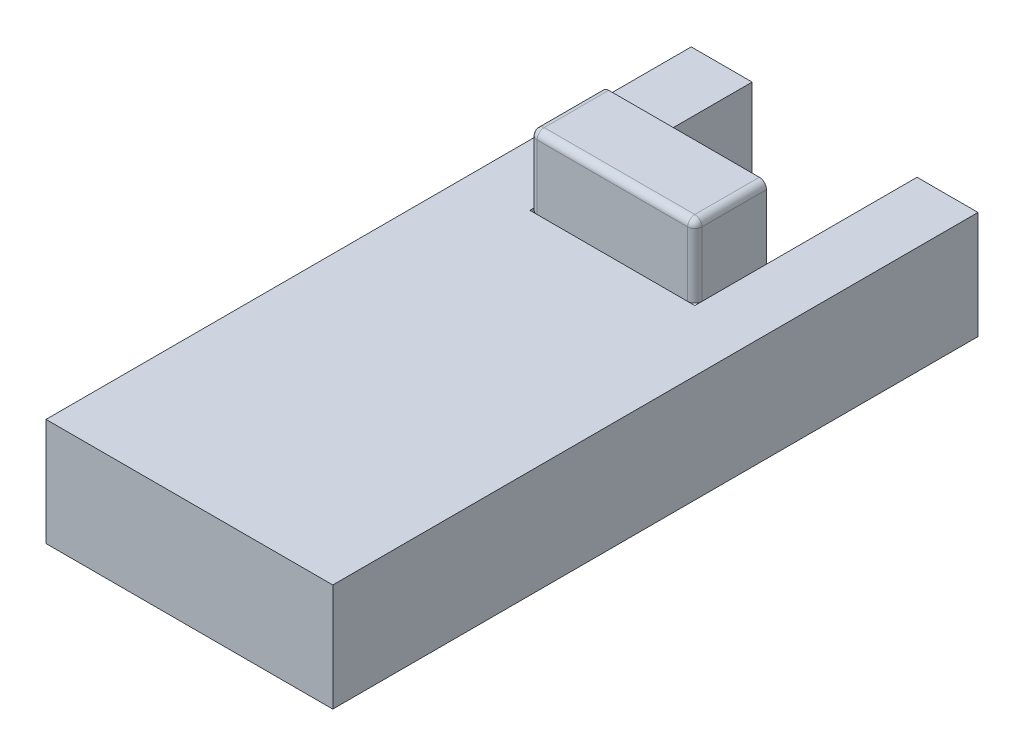
ISO-10303-21;
HEADER;
FILE_DESCRIPTION(('STEP AP214'),'2;1');
FILE_NAME('part.step','',(''),(''),'','','');
FILE_SCHEMA(('AUTOMOTIVE_DESIGN { 1 0 10303 214 1 1 1 1 }'));
ENDSEC;
DATA;
#1=APPLICATION_CONTEXT('core data for automotive mechanical design processes');
#2=APPLICATION_PROTOCOL_DEFINITION('international standard','automotive_design',2000,#1);
#3=PRODUCT_CONTEXT('',#1,'mechanical');
#4=PRODUCT('Part','Part','',(#3));
#5=PRODUCT_RELATED_PRODUCT_CATEGORY('part','',(#4));
#6=PRODUCT_DEFINITION_FORMATION('','',#4);
#7=PRODUCT_DEFINITION_CONTEXT('part definition',#1,'design');
#8=PRODUCT_DEFINITION('design','',#6,#7);
#9=PRODUCT_DEFINITION_SHAPE('','',#8);
#10=(LENGTH_UNIT() NAMED_UNIT(*) SI_UNIT(.MILLI.,.METRE.));
#11=(NAMED_UNIT(*) PLANE_ANGLE_UNIT() SI_UNIT($,.RADIAN.));
#12=(NAMED_UNIT(*) SI_UNIT($,.STERADIAN.) SOLID_ANGLE_UNIT());
#13=UNCERTAINTY_MEASURE_WITH_UNIT(LENGTH_MEASURE(1.E-05),#10,'distance_accuracy_value','');
#14=(GEOMETRIC_REPRESENTATION_CONTEXT(3) GLOBAL_UNCERTAINTY_ASSIGNED_CONTEXT((#13)) GLOBAL_UNIT_ASSIGNED_CONTEXT((#10,
#11,#12)) REPRESENTATION_CONTEXT('',''));
#15=CARTESIAN_POINT('',(0.,0.,0.));
#16=DIRECTION('',(0.,0.,1.));
#17=DIRECTION('',(1.,0.,0.));
#18=AXIS2_PLACEMENT_3D('',#15,#16,#17);
#19=CARTESIAN_POINT('',(105.,240.,-150.));
#20=DIRECTION('',(-1.,0.,0.));
#21=DIRECTION('',(0.,0.,1.));
#22=AXIS2_PLACEMENT_3D('',#19,#20,#21);
#23=SPHERICAL_SURFACE('',#22,10.);
#24=CARTESIAN_POINT('',(105.,240.,-150.));
#25=DIRECTION('',(0.,-1.,0.));
#26=DIRECTION('',(0.,0.,-1.));
#27=AXIS2_PLACEMENT_3D('',#24,#25,#26);
#28=CIRCLE('',#27,10.);
#29=CARTESIAN_POINT('',(115.,240.,-150.));
#30=VERTEX_POINT('',#29);
#31=CARTESIAN_POINT('',(105.,240.,-140.));
#32=VERTEX_POINT('',#31);
#33=EDGE_CURVE('E12',#30,#32,#28,.T.);
#34=ORIENTED_EDGE('',*,*,#33,.F.);
#35=CARTESIAN_POINT('',(105.,240.,-150.));
#36=DIRECTION('',(0.,0.,1.));
#37=DIRECTION('',(1.,0.,0.));
#38=AXIS2_PLACEMENT_3D('',#35,#36,#37);
#39=CIRCLE('',#38,10.);
#40=CARTESIAN_POINT('',(105.,250.,-150.));
#41=VERTEX_POINT('',#40);
#42=EDGE_CURVE('E56',#30,#41,#39,.T.);
#43=ORIENTED_EDGE('',*,*,#42,.T.);
#44=CARTESIAN_POINT('',(105.,240.,-150.));
#45=DIRECTION('',(-1.,0.,0.));
#46=DIRECTION('',(0.,0.,1.));
#47=AXIS2_PLACEMENT_3D('',#44,#45,#46);
#48=CIRCLE('',#47,10.);
#49=EDGE_CURVE('E176',#32,#41,#48,.T.);
#50=ORIENTED_EDGE('',*,*,#49,.F.);
#51=EDGE_LOOP('',(#34,#43,#50));
#52=FACE_BOUND('',#51,.T.);
#53=ADVANCED_FACE('F48',(#52),#23,.T.);
#54=CARTESIAN_POINT('',(105.,240.,-140.));
#55=DIRECTION('',(0.,0.,1.));
#56=DIRECTION('',(1.,0.,0.));
#57=AXIS2_PLACEMENT_3D('',#54,#55,#56);
#58=CYLINDRICAL_SURFACE('',#57,10.);
#59=ORIENTED_EDGE('',*,*,#42,.F.);
#60=DIRECTION('',(0.,0.,1.));
#61=VECTOR('',#60,1.);
#62=CARTESIAN_POINT('',(115.,240.,-140.));
#63=LINE('',#62,#61);
#64=CARTESIAN_POINT('',(115.,240.,-240.));
#65=VERTEX_POINT('',#64);
#66=EDGE_CURVE('E170',#65,#30,#63,.T.);
#67=ORIENTED_EDGE('',*,*,#66,.F.);
#68=CARTESIAN_POINT('',(105.,240.,-240.));
#69=DIRECTION('',(0.,0.,1.));
#70=DIRECTION('',(1.,0.,0.));
#71=AXIS2_PLACEMENT_3D('',#68,#69,#70);
#72=CIRCLE('',#71,10.);
#73=CARTESIAN_POINT('',(105.,250.,-240.));
#74=VERTEX_POINT('',#73);
#75=EDGE_CURVE('E120',#74,#65,#72,.F.);
#76=ORIENTED_EDGE('',*,*,#75,.F.);
#77=DIRECTION('',(0.,0.,1.));
#78=VECTOR('',#77,1.);
#79=CARTESIAN_POINT('',(105.,250.,0.));
#80=LINE('',#79,#78);
#81=EDGE_CURVE('E172',#41,#74,#80,.F.);
#82=ORIENTED_EDGE('',*,*,#81,.F.);
#83=EDGE_LOOP('',(#59,#67,#76,#82));
#84=FACE_BOUND('',#83,.T.);
#85=ADVANCED_FACE('F191',(#84),#58,.T.);
#86=CARTESIAN_POINT('',(105.,250.,-150.));
#87=DIRECTION('',(0.,-1.,0.));
#88=DIRECTION('',(0.,0.,-1.));
#89=AXIS2_PLACEMENT_3D('',#86,#87,#88);
#90=CYLINDRICAL_SURFACE('',#89,10.);
#91=DIRECTION('',(0.,-1.,0.));
#92=VECTOR('',#91,1.);
#93=CARTESIAN_POINT('',(115.,250.,-150.));
#94=LINE('',#93,#92);
#95=CARTESIAN_POINT('',(115.,150.,-150.));
#96=VERTEX_POINT('',#95);
#97=EDGE_CURVE('E130',#30,#96,#94,.T.);
#98=ORIENTED_EDGE('',*,*,#97,.F.);
#99=ORIENTED_EDGE('',*,*,#33,.T.);
#100=DIRECTION('',(0.,-1.,0.));
#101=VECTOR('',#100,1.);
#102=CARTESIAN_POINT('',(105.,250.,-140.));
#103=LINE('',#102,#101);
#104=CARTESIAN_POINT('',(105.,150.,-140.));
#105=VERTEX_POINT('',#104);
#106=EDGE_CURVE('E179',#105,#32,#103,.F.);
#107=ORIENTED_EDGE('',*,*,#106,.F.);
#108=CARTESIAN_POINT('',(105.,150.,-150.));
#109=DIRECTION('',(0.,-1.,0.));
#110=DIRECTION('',(0.,0.,-1.));
#111=AXIS2_PLACEMENT_3D('',#108,#109,#110);
#112=CIRCLE('',#111,10.);
#113=EDGE_CURVE('E63',#96,#105,#112,.T.);
#114=ORIENTED_EDGE('',*,*,#113,.F.);
#115=EDGE_LOOP('',(#98,#99,#107,#114));
#116=FACE_BOUND('',#115,.T.);
#117=ADVANCED_FACE('F50',(#116),#90,.T.);
#118=CARTESIAN_POINT('',(-105.,240.,-150.));
#119=DIRECTION('',(0.,0.,-1.));
#120=DIRECTION('',(-1.,0.,0.));
#121=AXIS2_PLACEMENT_3D('',#118,#119,#120);
#122=SPHERICAL_SURFACE('',#121,10.);
#123=CARTESIAN_POINT('',(-105.,240.,-150.));
#124=DIRECTION('',(0.,-1.,0.));
#125=DIRECTION('',(0.,0.,-1.));
#126=AXIS2_PLACEMENT_3D('',#123,#124,#125);
#127=CIRCLE('',#126,10.);
#128=CARTESIAN_POINT('',(-105.,240.,-140.));
#129=VERTEX_POINT('',#128);
#130=CARTESIAN_POINT('',(-115.,240.,-150.));
#131=VERTEX_POINT('',#130);
#132=EDGE_CURVE('E167',#129,#131,#127,.T.);
#133=ORIENTED_EDGE('',*,*,#132,.F.);
#134=CARTESIAN_POINT('',(-105.,240.,-150.));
#135=DIRECTION('',(-1.,0.,0.));
#136=DIRECTION('',(0.,0.,1.));
#137=AXIS2_PLACEMENT_3D('',#134,#135,#136);
#138=CIRCLE('',#137,10.);
#139=CARTESIAN_POINT('',(-105.,250.,-150.));
#140=VERTEX_POINT('',#139);
#141=EDGE_CURVE('E165',#129,#140,#138,.T.);
#142=ORIENTED_EDGE('',*,*,#141,.T.);
#143=CARTESIAN_POINT('',(-105.,240.,-150.));
#144=DIRECTION('',(0.,0.,-1.));
#145=DIRECTION('',(-1.,0.,0.));
#146=AXIS2_PLACEMENT_3D('',#143,#144,#145);
#147=CIRCLE('',#146,10.);
#148=EDGE_CURVE('E157',#131,#140,#147,.T.);
#149=ORIENTED_EDGE('',*,*,#148,.F.);
#150=EDGE_LOOP('',(#133,#142,#149));
#151=FACE_BOUND('',#150,.T.);
#152=ADVANCED_FACE('F202',(#151),#122,.T.);
#153=CARTESIAN_POINT('',(-115.,240.,-150.));
#154=DIRECTION('',(-1.,0.,0.));
#155=DIRECTION('',(0.,0.,1.));
#156=AXIS2_PLACEMENT_3D('',#153,#154,#155);
#157=CYLINDRICAL_SURFACE('',#156,10.);
#158=DIRECTION('',(-1.,0.,0.));
#159=VECTOR('',#158,1.);
#160=CARTESIAN_POINT('',(-115.,240.,-140.));
#161=LINE('',#160,#159);
#162=EDGE_CURVE('E152',#32,#129,#161,.T.);
#163=ORIENTED_EDGE('',*,*,#162,.F.);
#164=ORIENTED_EDGE('',*,*,#49,.T.);
#165=DIRECTION('',(-1.,0.,0.));
#166=VECTOR('',#165,1.);
#167=CARTESIAN_POINT('',(0.,250.,-150.));
#168=LINE('',#167,#166);
#169=EDGE_CURVE('E154',#140,#41,#168,.F.);
#170=ORIENTED_EDGE('',*,*,#169,.F.);
#171=ORIENTED_EDGE('',*,*,#141,.F.);
#172=EDGE_LOOP('',(#163,#164,#170,#171));
#173=FACE_BOUND('',#172,.T.);
#174=ADVANCED_FACE('F189',(#173),#157,.T.);
#175=CARTESIAN_POINT('',(-105.,250.,-150.));
#176=DIRECTION('',(0.,-1.,0.));
#177=DIRECTION('',(0.,0.,-1.));
#178=AXIS2_PLACEMENT_3D('',#175,#176,#177);
#179=CYLINDRICAL_SURFACE('',#178,10.);
#180=DIRECTION('',(0.,-1.,0.));
#181=VECTOR('',#180,1.);
#182=CARTESIAN_POINT('',(-105.,250.,-140.));
#183=LINE('',#182,#181);
#184=CARTESIAN_POINT('',(-105.,150.,-140.));
#185=VERTEX_POINT('',#184);
#186=EDGE_CURVE('E149',#129,#185,#183,.T.);
#187=ORIENTED_EDGE('',*,*,#186,.F.);
#188=ORIENTED_EDGE('',*,*,#132,.T.);
#189=DIRECTION('',(0.,-1.,0.));
#190=VECTOR('',#189,1.);
#191=CARTESIAN_POINT('',(-115.,250.,-150.));
#192=LINE('',#191,#190);
#193=CARTESIAN_POINT('',(-115.,150.,-150.));
#194=VERTEX_POINT('',#193);
#195=EDGE_CURVE('E160',#194,#131,#192,.F.);
#196=ORIENTED_EDGE('',*,*,#195,.F.);
#197=CARTESIAN_POINT('',(-105.,150.,-150.));
#198=DIRECTION('',(0.,-1.,0.));
#199=DIRECTION('',(0.,0.,-1.));
#200=AXIS2_PLACEMENT_3D('',#197,#198,#199);
#201=CIRCLE('',#200,10.);
#202=EDGE_CURVE('E163',#185,#194,#201,.T.);
#203=ORIENTED_EDGE('',*,*,#202,.F.);
#204=EDGE_LOOP('',(#187,#188,#196,#203));
#205=FACE_BOUND('',#204,.T.);
#206=ADVANCED_FACE('F205',(#205),#179,.T.);
#207=CARTESIAN_POINT('',(-105.,240.,-140.));
#208=DIRECTION('',(0.,0.,-1.));
#209=DIRECTION('',(-1.,0.,0.));
#210=AXIS2_PLACEMENT_3D('',#207,#208,#209);
#211=CYLINDRICAL_SURFACE('',#210,10.);
#212=DIRECTION('',(0.,0.,-1.));
#213=VECTOR('',#212,1.);
#214=CARTESIAN_POINT('',(-115.,240.,-140.));
#215=LINE('',#214,#213);
#216=CARTESIAN_POINT('',(-115.,240.,-240.));
#217=VERTEX_POINT('',#216);
#218=EDGE_CURVE('E124',#131,#217,#215,.T.);
#219=ORIENTED_EDGE('',*,*,#218,.F.);
#220=ORIENTED_EDGE('',*,*,#148,.T.);
#221=DIRECTION('',(0.,0.,-1.));
#222=VECTOR('',#221,1.);
#223=CARTESIAN_POINT('',(-105.,250.,0.));
#224=LINE('',#223,#222);
#225=CARTESIAN_POINT('',(-105.,250.,-240.));
#226=VERTEX_POINT('',#225);
#227=EDGE_CURVE('E143',#226,#140,#224,.F.);
#228=ORIENTED_EDGE('',*,*,#227,.F.);
#229=CARTESIAN_POINT('',(-105.,240.,-240.));
#230=DIRECTION('',(0.,0.,1.));
#231=DIRECTION('',(1.,0.,0.));
#232=AXIS2_PLACEMENT_3D('',#229,#230,#231);
#233=CIRCLE('',#232,10.);
#234=EDGE_CURVE('E146',#217,#226,#233,.F.);
#235=ORIENTED_EDGE('',*,*,#234,.F.);
#236=EDGE_LOOP('',(#219,#220,#228,#235));
#237=FACE_BOUND('',#236,.T.);
#238=ADVANCED_FACE('F198',(#237),#211,.T.);
#239=CARTESIAN_POINT('',(-115.,250.,-140.));
#240=DIRECTION('',(1.,0.,0.));
#241=DIRECTION('',(0.,0.,-1.));
#242=AXIS2_PLACEMENT_3D('',#239,#240,#241);
#243=PLANE('',#242);
#244=DIRECTION('',(0.,0.,1.));
#245=VECTOR('',#244,1.);
#246=CARTESIAN_POINT('',(-115.,150.,-140.));
#247=LINE('',#246,#245);
#248=CARTESIAN_POINT('',(-115.,150.,-240.));
#249=VERTEX_POINT('',#248);
#250=EDGE_CURVE('E135',#249,#194,#247,.T.);
#251=ORIENTED_EDGE('',*,*,#250,.T.);
#252=ORIENTED_EDGE('',*,*,#195,.T.);
#253=ORIENTED_EDGE('',*,*,#218,.T.);
#254=DIRECTION('',(0.,-1.,0.));
#255=VECTOR('',#254,1.);
#256=CARTESIAN_POINT('',(-115.,250.,-240.));
#257=LINE('',#256,#255);
#258=EDGE_CURVE('E125',#217,#249,#257,.T.);
#259=ORIENTED_EDGE('',*,*,#258,.T.);
#260=EDGE_LOOP('',(#251,#252,#253,#259));
#261=FACE_BOUND('',#260,.T.);
#262=ADVANCED_FACE('F212',(#261),#243,.F.);
#263=CARTESIAN_POINT('',(-115.,250.,-140.));
#264=DIRECTION('',(0.,0.,-1.));
#265=DIRECTION('',(-1.,0.,0.));
#266=AXIS2_PLACEMENT_3D('',#263,#264,#265);
#267=PLANE('',#266);
#268=DIRECTION('',(1.,0.,0.));
#269=VECTOR('',#268,1.);
#270=CARTESIAN_POINT('',(-115.,150.,-140.));
#271=LINE('',#270,#269);
#272=EDGE_CURVE('E131',#185,#105,#271,.T.);
#273=ORIENTED_EDGE('',*,*,#272,.T.);
#274=ORIENTED_EDGE('',*,*,#106,.T.);
#275=ORIENTED_EDGE('',*,*,#162,.T.);
#276=ORIENTED_EDGE('',*,*,#186,.T.);
#277=EDGE_LOOP('',(#273,#274,#275,#276));
#278=FACE_BOUND('',#277,.T.);
#279=ADVANCED_FACE('F209',(#278),#267,.F.);
#280=CARTESIAN_POINT('',(115.,250.,-140.));
#281=DIRECTION('',(-1.,0.,0.));
#282=DIRECTION('',(0.,0.,1.));
#283=AXIS2_PLACEMENT_3D('',#280,#281,#282);
#284=PLANE('',#283);
#285=DIRECTION('',(0.,-1.,0.));
#286=VECTOR('',#285,1.);
#287=CARTESIAN_POINT('',(115.,250.,-240.));
#288=LINE('',#287,#286);
#289=CARTESIAN_POINT('',(115.,150.,-240.));
#290=VERTEX_POINT('',#289);
#291=EDGE_CURVE('E112',#65,#290,#288,.T.);
#292=ORIENTED_EDGE('',*,*,#291,.F.);
#293=ORIENTED_EDGE('',*,*,#66,.T.);
#294=ORIENTED_EDGE('',*,*,#97,.T.);
#295=DIRECTION('',(0.,0.,-1.));
#296=VECTOR('',#295,1.);
#297=CARTESIAN_POINT('',(115.,150.,-140.));
#298=LINE('',#297,#296);
#299=EDGE_CURVE('E128',#96,#290,#298,.T.);
#300=ORIENTED_EDGE('',*,*,#299,.T.);
#301=EDGE_LOOP('',(#292,#293,#294,#300));
#302=FACE_BOUND('',#301,.T.);
#303=ADVANCED_FACE('F129',(#302),#284,.F.);
#304=CARTESIAN_POINT('',(-115.,250.,-240.));
#305=DIRECTION('',(0.,0.,1.));
#306=DIRECTION('',(1.,0.,0.));
#307=AXIS2_PLACEMENT_3D('',#304,#305,#306);
#308=PLANE('',#307);
#309=DIRECTION('',(-1.,0.,0.));
#310=VECTOR('',#309,1.);
#311=CARTESIAN_POINT('',(-115.,250.,-240.));
#312=LINE('',#311,#310);
#313=EDGE_CURVE('E136',#74,#226,#312,.T.);
#314=ORIENTED_EDGE('',*,*,#313,.F.);
#315=ORIENTED_EDGE('',*,*,#75,.T.);
#316=ORIENTED_EDGE('',*,*,#291,.T.);
#317=DIRECTION('',(-1.,0.,0.));
#318=VECTOR('',#317,1.);
#319=CARTESIAN_POINT('',(-115.,150.,-240.));
#320=LINE('',#319,#318);
#321=EDGE_CURVE('E118',#290,#249,#320,.T.);
#322=ORIENTED_EDGE('',*,*,#321,.T.);
#323=ORIENTED_EDGE('',*,*,#258,.F.);
#324=ORIENTED_EDGE('',*,*,#234,.T.);
#325=EDGE_LOOP('',(#314,#315,#316,#322,#323,#324));
#326=FACE_BOUND('',#325,.T.);
#327=ADVANCED_FACE('F115',(#326),#308,.F.);
#328=CARTESIAN_POINT('',(0.,250.,0.));
#329=DIRECTION('',(0.,-1.,0.));
#330=DIRECTION('',(0.,0.,-1.));
#331=AXIS2_PLACEMENT_3D('',#328,#329,#330);
#332=PLANE('',#331);
#333=ORIENTED_EDGE('',*,*,#169,.T.);
#334=ORIENTED_EDGE('',*,*,#81,.T.);
#335=ORIENTED_EDGE('',*,*,#313,.T.);
#336=ORIENTED_EDGE('',*,*,#227,.T.);
#337=EDGE_LOOP('',(#333,#334,#335,#336));
#338=FACE_BOUND('',#337,.T.);
#339=ADVANCED_FACE('F193',(#338),#332,.F.);
#340=CARTESIAN_POINT('',(0.,150.,0.));
#341=DIRECTION('',(0.,-1.,0.));
#342=DIRECTION('',(0.,0.,-1.));
#343=AXIS2_PLACEMENT_3D('',#340,#341,#342);
#344=PLANE('',#343);
#345=ORIENTED_EDGE('',*,*,#299,.F.);
#346=ORIENTED_EDGE('',*,*,#113,.T.);
#347=ORIENTED_EDGE('',*,*,#272,.F.);
#348=ORIENTED_EDGE('',*,*,#202,.T.);
#349=ORIENTED_EDGE('',*,*,#250,.F.);
#350=ORIENTED_EDGE('',*,*,#321,.F.);
#351=EDGE_LOOP('',(#345,#346,#347,#348,#349,#350));
#352=FACE_BOUND('',#351,.T.);
#353=ADVANCED_FACE('F133',(#352),#344,.T.);
#354=CLOSED_SHELL('',(#53,#85,#117,#152,#174,#206,#238,#262,#279,#303,#327,#339,#353));
#355=MANIFOLD_SOLID_BREP('B2',#354);
#356=CARTESIAN_POINT('',(200.,150.,-450.));
#357=DIRECTION('',(0.,0.,1.));
#358=DIRECTION('',(1.,0.,0.));
#359=AXIS2_PLACEMENT_3D('',#356,#357,#358);
#360=PLANE('',#359);
#361=DIRECTION('',(-1.,0.,0.));
#362=VECTOR('',#361,1.);
#363=CARTESIAN_POINT('',(200.,0.,-450.));
#364=LINE('',#363,#362);
#365=CARTESIAN_POINT('',(200.,0.,-450.));
#366=VERTEX_POINT('',#365);
#367=CARTESIAN_POINT('',(115.,0.,-450.));
#368=VERTEX_POINT('',#367);
#369=EDGE_CURVE('E435',#366,#368,#364,.T.);
#370=ORIENTED_EDGE('',*,*,#369,.T.);
#371=DIRECTION('',(0.,1.,0.));
#372=VECTOR('',#371,1.);
#373=CARTESIAN_POINT('',(115.,150.,-450.));
#374=LINE('',#373,#372);
#375=CARTESIAN_POINT('',(115.,150.,-450.));
#376=VERTEX_POINT('',#375);
#377=EDGE_CURVE('E428',#368,#376,#374,.T.);
#378=ORIENTED_EDGE('',*,*,#377,.T.);
#379=DIRECTION('',(-1.,0.,0.));
#380=VECTOR('',#379,1.);
#381=CARTESIAN_POINT('',(200.,150.,-450.));
#382=LINE('',#381,#380);
#383=CARTESIAN_POINT('',(200.,150.,-450.));
#384=VERTEX_POINT('',#383);
#385=EDGE_CURVE('E411',#384,#376,#382,.T.);
#386=ORIENTED_EDGE('',*,*,#385,.F.);
#387=DIRECTION('',(0.,-1.,0.));
#388=VECTOR('',#387,1.);
#389=CARTESIAN_POINT('',(200.,150.,-450.));
#390=LINE('',#389,#388);
#391=EDGE_CURVE('E458',#384,#366,#390,.T.);
#392=ORIENTED_EDGE('',*,*,#391,.T.);
#393=EDGE_LOOP('',(#370,#378,#386,#392));
#394=FACE_BOUND('',#393,.T.);
#395=ADVANCED_FACE('F317',(#394),#360,.F.);
#396=CARTESIAN_POINT('',(-200.,150.,450.));
#397=DIRECTION('',(1.,0.,0.));
#398=DIRECTION('',(0.,0.,-1.));
#399=AXIS2_PLACEMENT_3D('',#396,#397,#398);
#400=PLANE('',#399);
#401=DIRECTION('',(0.,0.,1.));
#402=VECTOR('',#401,1.);
#403=CARTESIAN_POINT('',(-200.,0.,450.));
#404=LINE('',#403,#402);
#405=CARTESIAN_POINT('',(-200.,0.,-450.));
#406=VERTEX_POINT('',#405);
#407=CARTESIAN_POINT('',(-200.,0.,450.));
#408=VERTEX_POINT('',#407);
#409=EDGE_CURVE('E431',#406,#408,#404,.T.);
#410=ORIENTED_EDGE('',*,*,#409,.T.);
#411=DIRECTION('',(0.,-1.,0.));
#412=VECTOR('',#411,1.);
#413=CARTESIAN_POINT('',(-200.,150.,450.));
#414=LINE('',#413,#412);
#415=CARTESIAN_POINT('',(-200.,150.,450.));
#416=VERTEX_POINT('',#415);
#417=EDGE_CURVE('E326',#416,#408,#414,.T.);
#418=ORIENTED_EDGE('',*,*,#417,.F.);
#419=DIRECTION('',(0.,0.,1.));
#420=VECTOR('',#419,1.);
#421=CARTESIAN_POINT('',(-200.,150.,450.));
#422=LINE('',#421,#420);
#423=CARTESIAN_POINT('',(-200.,150.,-450.));
#424=VERTEX_POINT('',#423);
#425=EDGE_CURVE('E432',#424,#416,#422,.T.);
#426=ORIENTED_EDGE('',*,*,#425,.F.);
#427=DIRECTION('',(0.,-1.,0.));
#428=VECTOR('',#427,1.);
#429=CARTESIAN_POINT('',(-200.,150.,-450.));
#430=LINE('',#429,#428);
#431=EDGE_CURVE('E443',#424,#406,#430,.T.);
#432=ORIENTED_EDGE('',*,*,#431,.T.);
#433=EDGE_LOOP('',(#410,#418,#426,#432));
#434=FACE_BOUND('',#433,.T.);
#435=ADVANCED_FACE('F319',(#434),#400,.F.);
#436=CARTESIAN_POINT('',(200.,150.,450.));
#437=DIRECTION('',(0.,0.,-1.));
#438=DIRECTION('',(-1.,0.,0.));
#439=AXIS2_PLACEMENT_3D('',#436,#437,#438);
#440=PLANE('',#439);
#441=DIRECTION('',(1.,0.,0.));
#442=VECTOR('',#441,1.);
#443=CARTESIAN_POINT('',(200.,0.,450.));
#444=LINE('',#443,#442);
#445=CARTESIAN_POINT('',(200.,0.,450.));
#446=VERTEX_POINT('',#445);
#447=EDGE_CURVE('E447',#408,#446,#444,.T.);
#448=ORIENTED_EDGE('',*,*,#447,.T.);
#449=DIRECTION('',(0.,-1.,0.));
#450=VECTOR('',#449,1.);
#451=CARTESIAN_POINT('',(200.,150.,450.));
#452=LINE('',#451,#450);
#453=CARTESIAN_POINT('',(200.,150.,450.));
#454=VERTEX_POINT('',#453);
#455=EDGE_CURVE('E462',#454,#446,#452,.T.);
#456=ORIENTED_EDGE('',*,*,#455,.F.);
#457=DIRECTION('',(1.,0.,0.));
#458=VECTOR('',#457,1.);
#459=CARTESIAN_POINT('',(200.,150.,450.));
#460=LINE('',#459,#458);
#461=EDGE_CURVE('E372',#416,#454,#460,.T.);
#462=ORIENTED_EDGE('',*,*,#461,.F.);
#463=ORIENTED_EDGE('',*,*,#417,.T.);
#464=EDGE_LOOP('',(#448,#456,#462,#463));
#465=FACE_BOUND('',#464,.T.);
#466=ADVANCED_FACE('F467',(#465),#440,.F.);
#467=CARTESIAN_POINT('',(200.,150.,450.));
#468=DIRECTION('',(-1.,0.,0.));
#469=DIRECTION('',(0.,0.,1.));
#470=AXIS2_PLACEMENT_3D('',#467,#468,#469);
#471=PLANE('',#470);
#472=DIRECTION('',(0.,0.,-1.));
#473=VECTOR('',#472,1.);
#474=CARTESIAN_POINT('',(200.,0.,450.));
#475=LINE('',#474,#473);
#476=EDGE_CURVE('E450',#446,#366,#475,.T.);
#477=ORIENTED_EDGE('',*,*,#476,.T.);
#478=ORIENTED_EDGE('',*,*,#391,.F.);
#479=DIRECTION('',(0.,0.,-1.));
#480=VECTOR('',#479,1.);
#481=CARTESIAN_POINT('',(200.,150.,450.));
#482=LINE('',#481,#480);
#483=EDGE_CURVE('E438',#454,#384,#482,.T.);
#484=ORIENTED_EDGE('',*,*,#483,.F.);
#485=ORIENTED_EDGE('',*,*,#455,.T.);
#486=EDGE_LOOP('',(#477,#478,#484,#485));
#487=FACE_BOUND('',#486,.T.);
#488=ADVANCED_FACE('F478',(#487),#471,.F.);
#489=CARTESIAN_POINT('',(-115.,150.,-450.));
#490=VERTEX_POINT('',#489);
#491=EDGE_CURVE('E342',#490,#424,#382,.T.);
#492=ORIENTED_EDGE('',*,*,#491,.F.);
#493=DIRECTION('',(0.,-1.,0.));
#494=VECTOR('',#493,1.);
#495=CARTESIAN_POINT('',(-115.,150.,-450.));
#496=LINE('',#495,#494);
#497=CARTESIAN_POINT('',(-115.,0.,-450.));
#498=VERTEX_POINT('',#497);
#499=EDGE_CURVE('E424',#490,#498,#496,.T.);
#500=ORIENTED_EDGE('',*,*,#499,.T.);
#501=EDGE_CURVE('E364',#498,#406,#364,.T.);
#502=ORIENTED_EDGE('',*,*,#501,.T.);
#503=ORIENTED_EDGE('',*,*,#431,.F.);
#504=EDGE_LOOP('',(#492,#500,#502,#503));
#505=FACE_BOUND('',#504,.T.);
#506=ADVANCED_FACE('F483',(#505),#360,.F.);
#507=CARTESIAN_POINT('',(0.,150.,0.));
#508=DIRECTION('',(0.,1.,0.));
#509=DIRECTION('',(0.,0.,1.));
#510=AXIS2_PLACEMENT_3D('',#507,#508,#509);
#511=PLANE('',#510);
#512=DIRECTION('',(0.,0.,1.));
#513=VECTOR('',#512,1.);
#514=CARTESIAN_POINT('',(115.,150.,-760.));
#515=LINE('',#514,#513);
#516=CARTESIAN_POINT('',(115.,150.,-140.));
#517=VERTEX_POINT('',#516);
#518=EDGE_CURVE('E395',#376,#517,#515,.T.);
#519=ORIENTED_EDGE('',*,*,#518,.T.);
#520=DIRECTION('',(-1.,0.,0.));
#521=VECTOR('',#520,1.);
#522=CARTESIAN_POINT('',(-115.,150.,-140.));
#523=LINE('',#522,#521);
#524=CARTESIAN_POINT('',(-115.,150.,-140.));
#525=VERTEX_POINT('',#524);
#526=EDGE_CURVE('E403',#517,#525,#523,.T.);
#527=ORIENTED_EDGE('',*,*,#526,.T.);
#528=DIRECTION('',(0.,0.,-1.));
#529=VECTOR('',#528,1.);
#530=CARTESIAN_POINT('',(-115.,150.,-760.));
#531=LINE('',#530,#529);
#532=EDGE_CURVE('E400',#525,#490,#531,.T.);
#533=ORIENTED_EDGE('',*,*,#532,.T.);
#534=ORIENTED_EDGE('',*,*,#491,.T.);
#535=ORIENTED_EDGE('',*,*,#425,.T.);
#536=ORIENTED_EDGE('',*,*,#461,.T.);
#537=ORIENTED_EDGE('',*,*,#483,.T.);
#538=ORIENTED_EDGE('',*,*,#385,.T.);
#539=EDGE_LOOP('',(#519,#527,#533,#534,#535,#536,#537,#538));
#540=FACE_BOUND('',#539,.T.);
#541=ADVANCED_FACE('F409',(#540),#511,.T.);
#542=CARTESIAN_POINT('',(0.,0.,0.));
#543=DIRECTION('',(0.,1.,0.));
#544=DIRECTION('',(0.,0.,1.));
#545=AXIS2_PLACEMENT_3D('',#542,#543,#544);
#546=PLANE('',#545);
#547=DIRECTION('',(-1.,0.,0.));
#548=VECTOR('',#547,1.);
#549=CARTESIAN_POINT('',(-115.,0.,-140.));
#550=LINE('',#549,#548);
#551=CARTESIAN_POINT('',(115.,0.,-140.));
#552=VERTEX_POINT('',#551);
#553=CARTESIAN_POINT('',(-115.,0.,-140.));
#554=VERTEX_POINT('',#553);
#555=EDGE_CURVE('E416',#552,#554,#550,.T.);
#556=ORIENTED_EDGE('',*,*,#555,.F.);
#557=DIRECTION('',(0.,0.,-1.));
#558=VECTOR('',#557,1.);
#559=CARTESIAN_POINT('',(115.,0.,0.));
#560=LINE('',#559,#558);
#561=EDGE_CURVE('E46',#552,#368,#560,.T.);
#562=ORIENTED_EDGE('',*,*,#561,.T.);
#563=ORIENTED_EDGE('',*,*,#369,.F.);
#564=ORIENTED_EDGE('',*,*,#476,.F.);
#565=ORIENTED_EDGE('',*,*,#447,.F.);
#566=ORIENTED_EDGE('',*,*,#409,.F.);
#567=ORIENTED_EDGE('',*,*,#501,.F.);
#568=DIRECTION('',(0.,0.,-1.));
#569=VECTOR('',#568,1.);
#570=CARTESIAN_POINT('',(-115.,0.,-760.));
#571=LINE('',#570,#569);
#572=EDGE_CURVE('E413',#554,#498,#571,.T.);
#573=ORIENTED_EDGE('',*,*,#572,.F.);
#574=EDGE_LOOP('',(#556,#562,#563,#564,#565,#566,#567,#573));
#575=FACE_BOUND('',#574,.T.);
#576=ADVANCED_FACE('F472',(#575),#546,.F.);
#577=CARTESIAN_POINT('',(115.,150.,-760.));
#578=DIRECTION('',(1.,0.,0.));
#579=DIRECTION('',(0.,0.,-1.));
#580=AXIS2_PLACEMENT_3D('',#577,#578,#579);
#581=PLANE('',#580);
#582=ORIENTED_EDGE('',*,*,#561,.F.);
#583=DIRECTION('',(0.,-1.,0.));
#584=VECTOR('',#583,1.);
#585=CARTESIAN_POINT('',(115.,150.,-140.));
#586=LINE('',#585,#584);
#587=EDGE_CURVE('E333',#517,#552,#586,.T.);
#588=ORIENTED_EDGE('',*,*,#587,.F.);
#589=ORIENTED_EDGE('',*,*,#518,.F.);
#590=ORIENTED_EDGE('',*,*,#377,.F.);
#591=EDGE_LOOP('',(#582,#588,#589,#590));
#592=FACE_BOUND('',#591,.T.);
#593=ADVANCED_FACE('F393',(#592),#581,.F.);
#594=CARTESIAN_POINT('',(-115.,150.,-760.));
#595=DIRECTION('',(-1.,0.,0.));
#596=DIRECTION('',(0.,0.,1.));
#597=AXIS2_PLACEMENT_3D('',#594,#595,#596);
#598=PLANE('',#597);
#599=ORIENTED_EDGE('',*,*,#532,.F.);
#600=DIRECTION('',(0.,-1.,0.));
#601=VECTOR('',#600,1.);
#602=CARTESIAN_POINT('',(-115.,150.,-140.));
#603=LINE('',#602,#601);
#604=EDGE_CURVE('E399',#525,#554,#603,.T.);
#605=ORIENTED_EDGE('',*,*,#604,.T.);
#606=ORIENTED_EDGE('',*,*,#572,.T.);
#607=ORIENTED_EDGE('',*,*,#499,.F.);
#608=EDGE_LOOP('',(#599,#605,#606,#607));
#609=FACE_BOUND('',#608,.T.);
#610=ADVANCED_FACE('F482',(#609),#598,.F.);
#611=CARTESIAN_POINT('',(-115.,150.,-140.));
#612=DIRECTION('',(0.,0.,1.));
#613=DIRECTION('',(1.,0.,0.));
#614=AXIS2_PLACEMENT_3D('',#611,#612,#613);
#615=PLANE('',#614);
#616=ORIENTED_EDGE('',*,*,#555,.T.);
#617=ORIENTED_EDGE('',*,*,#604,.F.);
#618=ORIENTED_EDGE('',*,*,#526,.F.);
#619=ORIENTED_EDGE('',*,*,#587,.T.);
#620=EDGE_LOOP('',(#616,#617,#618,#619));
#621=FACE_BOUND('',#620,.T.);
#622=ADVANCED_FACE('F404',(#621),#615,.F.);
#623=CLOSED_SHELL('',(#395,#435,#466,#488,#506,#541,#576,#593,#610,#622));
#624=MANIFOLD_SOLID_BREP('B6',#623);
#625=ADVANCED_BREP_SHAPE_REPRESENTATION('',(#18,#355,#624),#14);
#626=SHAPE_DEFINITION_REPRESENTATION(#9,#625);
ENDSEC;
END-ISO-10303-21;
